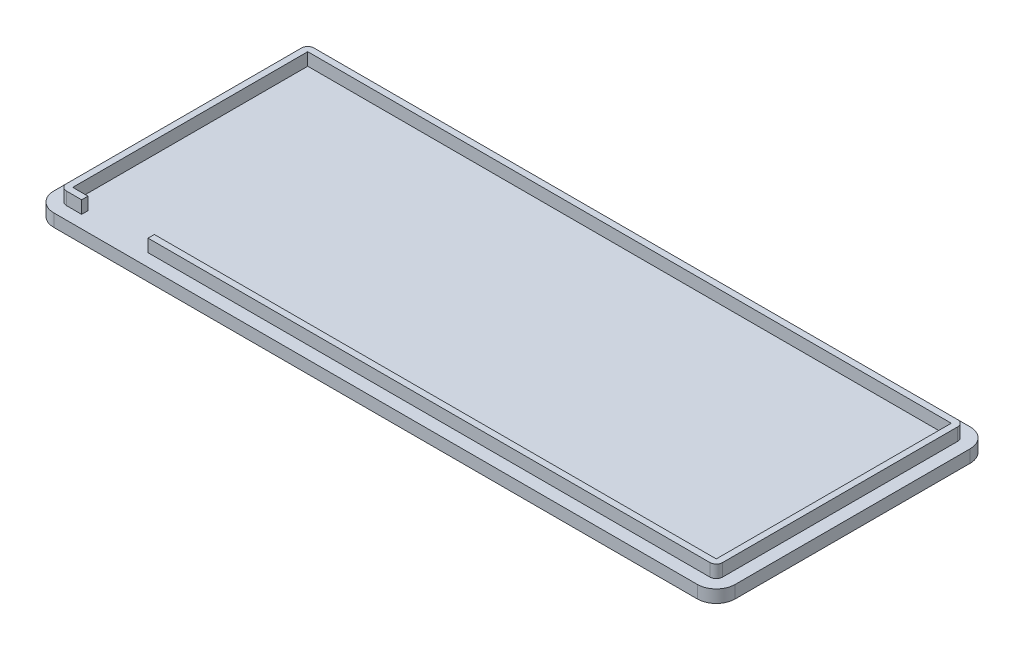
ISO-10303-21;
HEADER;
FILE_DESCRIPTION(('STEP AP214'),'2;1');
FILE_NAME('part.step','',(''),(''),'','','');
FILE_SCHEMA(('AUTOMOTIVE_DESIGN { 1 0 10303 214 1 1 1 1 }'));
ENDSEC;
DATA;
#1=APPLICATION_CONTEXT('core data for automotive mechanical design processes');
#2=APPLICATION_PROTOCOL_DEFINITION('international standard','automotive_design',2000,#1);
#3=PRODUCT_CONTEXT('',#1,'mechanical');
#4=PRODUCT('Part','Part','',(#3));
#5=PRODUCT_RELATED_PRODUCT_CATEGORY('part','',(#4));
#6=PRODUCT_DEFINITION_FORMATION('','',#4);
#7=PRODUCT_DEFINITION_CONTEXT('part definition',#1,'design');
#8=PRODUCT_DEFINITION('design','',#6,#7);
#9=PRODUCT_DEFINITION_SHAPE('','',#8);
#10=(LENGTH_UNIT() NAMED_UNIT(*) SI_UNIT(.MILLI.,.METRE.));
#11=(NAMED_UNIT(*) PLANE_ANGLE_UNIT() SI_UNIT($,.RADIAN.));
#12=(NAMED_UNIT(*) SI_UNIT($,.STERADIAN.) SOLID_ANGLE_UNIT());
#13=UNCERTAINTY_MEASURE_WITH_UNIT(LENGTH_MEASURE(1.E-05),#10,'distance_accuracy_value','');
#14=(GEOMETRIC_REPRESENTATION_CONTEXT(3) GLOBAL_UNCERTAINTY_ASSIGNED_CONTEXT((#13)) GLOBAL_UNIT_ASSIGNED_CONTEXT((#10,
#11,#12)) REPRESENTATION_CONTEXT('',''));
#15=CARTESIAN_POINT('',(0.,0.,0.));
#16=DIRECTION('',(0.,0.,1.));
#17=DIRECTION('',(1.,0.,0.));
#18=AXIS2_PLACEMENT_3D('',#15,#16,#17);
#19=CARTESIAN_POINT('',(51.,4.,19.625));
#20=DIRECTION('',(0.,0.,-1.));
#21=DIRECTION('',(-1.,0.,0.));
#22=AXIS2_PLACEMENT_3D('',#19,#20,#21);
#23=PLANE('',#22);
#24=DIRECTION('',(1.,0.,0.));
#25=VECTOR('',#24,1.);
#26=CARTESIAN_POINT('',(51.,2.,19.625));
#27=LINE('',#26,#25);
#28=CARTESIAN_POINT('',(-51.,2.,19.625));
#29=VERTEX_POINT('',#28);
#30=CARTESIAN_POINT('',(-48.5847,2.,19.625));
#31=VERTEX_POINT('',#30);
#32=EDGE_CURVE('E55',#29,#31,#27,.T.);
#33=ORIENTED_EDGE('',*,*,#32,.T.);
#34=DIRECTION('',(0.,-1.,0.));
#35=VECTOR('',#34,1.);
#36=CARTESIAN_POINT('',(-48.5847,2.,19.625));
#37=LINE('',#36,#35);
#38=CARTESIAN_POINT('',(-48.5847,4.,19.625));
#39=VERTEX_POINT('',#38);
#40=EDGE_CURVE('E202',#39,#31,#37,.T.);
#41=ORIENTED_EDGE('',*,*,#40,.F.);
#42=DIRECTION('',(1.,0.,0.));
#43=VECTOR('',#42,1.);
#44=CARTESIAN_POINT('',(51.,4.,19.625));
#45=LINE('',#44,#43);
#46=CARTESIAN_POINT('',(-51.,4.,19.625));
#47=VERTEX_POINT('',#46);
#48=EDGE_CURVE('E390',#47,#39,#45,.T.);
#49=ORIENTED_EDGE('',*,*,#48,.F.);
#50=DIRECTION('',(0.,-1.,0.));
#51=VECTOR('',#50,1.);
#52=CARTESIAN_POINT('',(-51.,4.,19.625));
#53=LINE('',#52,#51);
#54=EDGE_CURVE('E210',#47,#29,#53,.T.);
#55=ORIENTED_EDGE('',*,*,#54,.T.);
#56=EDGE_LOOP('',(#33,#41,#49,#55));
#57=FACE_BOUND('',#56,.T.);
#58=ADVANCED_FACE('F33',(#57),#23,.F.);
#59=CARTESIAN_POINT('',(51.,4.,18.625));
#60=DIRECTION('',(0.,0.,-1.));
#61=DIRECTION('',(-1.,0.,0.));
#62=AXIS2_PLACEMENT_3D('',#59,#60,#61);
#63=PLANE('',#62);
#64=DIRECTION('',(0.,1.,0.));
#65=VECTOR('',#64,1.);
#66=CARTESIAN_POINT('',(-48.5847,4.,18.625));
#67=LINE('',#66,#65);
#68=CARTESIAN_POINT('',(-48.5847,2.,18.625));
#69=VERTEX_POINT('',#68);
#70=CARTESIAN_POINT('',(-48.5847,4.,18.625));
#71=VERTEX_POINT('',#70);
#72=EDGE_CURVE('E447',#69,#71,#67,.T.);
#73=ORIENTED_EDGE('',*,*,#72,.F.);
#74=DIRECTION('',(1.,0.,0.));
#75=VECTOR('',#74,1.);
#76=CARTESIAN_POINT('',(51.,2.,18.625));
#77=LINE('',#76,#75);
#78=CARTESIAN_POINT('',(-51.,2.,18.625));
#79=VERTEX_POINT('',#78);
#80=EDGE_CURVE('E196',#79,#69,#77,.T.);
#81=ORIENTED_EDGE('',*,*,#80,.F.);
#82=DIRECTION('',(0.,-1.,0.));
#83=VECTOR('',#82,1.);
#84=CARTESIAN_POINT('',(-51.,4.,18.625));
#85=LINE('',#84,#83);
#86=CARTESIAN_POINT('',(-51.,4.,18.625));
#87=VERTEX_POINT('',#86);
#88=EDGE_CURVE('E412',#87,#79,#85,.T.);
#89=ORIENTED_EDGE('',*,*,#88,.F.);
#90=DIRECTION('',(1.,0.,0.));
#91=VECTOR('',#90,1.);
#92=CARTESIAN_POINT('',(51.,4.,18.625));
#93=LINE('',#92,#91);
#94=EDGE_CURVE('E441',#87,#71,#93,.T.);
#95=ORIENTED_EDGE('',*,*,#94,.T.);
#96=EDGE_LOOP('',(#73,#81,#89,#95));
#97=FACE_BOUND('',#96,.T.);
#98=ADVANCED_FACE('F360',(#97),#63,.T.);
#99=CARTESIAN_POINT('',(-51.,2.,18.625));
#100=DIRECTION('',(0.,-1.,0.));
#101=DIRECTION('',(0.,0.,-1.));
#102=AXIS2_PLACEMENT_3D('',#99,#100,#101);
#103=CYLINDRICAL_SURFACE('',#102,3.);
#104=CARTESIAN_POINT('',(-51.,0.,18.625));
#105=DIRECTION('',(0.,1.,0.));
#106=DIRECTION('',(0.,0.,-1.));
#107=AXIS2_PLACEMENT_3D('',#104,#105,#106);
#108=CIRCLE('',#107,3.);
#109=CARTESIAN_POINT('',(-54.,0.,18.625));
#110=VERTEX_POINT('',#109);
#111=CARTESIAN_POINT('',(-51.,0.,21.625));
#112=VERTEX_POINT('',#111);
#113=EDGE_CURVE('E260',#110,#112,#108,.T.);
#114=ORIENTED_EDGE('',*,*,#113,.T.);
#115=DIRECTION('',(0.,-1.,0.));
#116=VECTOR('',#115,1.);
#117=CARTESIAN_POINT('',(-51.,2.,21.625));
#118=LINE('',#117,#116);
#119=CARTESIAN_POINT('',(-51.,2.,21.625));
#120=VERTEX_POINT('',#119);
#121=EDGE_CURVE('E11',#120,#112,#118,.T.);
#122=ORIENTED_EDGE('',*,*,#121,.F.);
#123=CARTESIAN_POINT('',(-51.,2.,18.625));
#124=DIRECTION('',(0.,1.,0.));
#125=DIRECTION('',(0.,0.,-1.));
#126=AXIS2_PLACEMENT_3D('',#123,#124,#125);
#127=CIRCLE('',#126,3.);
#128=CARTESIAN_POINT('',(-54.,2.,18.625));
#129=VERTEX_POINT('',#128);
#130=EDGE_CURVE('E261',#129,#120,#127,.T.);
#131=ORIENTED_EDGE('',*,*,#130,.F.);
#132=DIRECTION('',(0.,-1.,0.));
#133=VECTOR('',#132,1.);
#134=CARTESIAN_POINT('',(-54.,2.,18.625));
#135=LINE('',#134,#133);
#136=EDGE_CURVE('E279',#129,#110,#135,.T.);
#137=ORIENTED_EDGE('',*,*,#136,.T.);
#138=EDGE_LOOP('',(#114,#122,#131,#137));
#139=FACE_BOUND('',#138,.T.);
#140=ADVANCED_FACE('F35',(#139),#103,.T.);
#141=CARTESIAN_POINT('',(51.,2.,21.625));
#142=DIRECTION('',(0.,0.,-1.));
#143=DIRECTION('',(-1.,0.,0.));
#144=AXIS2_PLACEMENT_3D('',#141,#142,#143);
#145=PLANE('',#144);
#146=DIRECTION('',(1.,0.,0.));
#147=VECTOR('',#146,1.);
#148=CARTESIAN_POINT('',(51.,0.,21.625));
#149=LINE('',#148,#147);
#150=CARTESIAN_POINT('',(51.,0.,21.625));
#151=VERTEX_POINT('',#150);
#152=EDGE_CURVE('E282',#112,#151,#149,.T.);
#153=ORIENTED_EDGE('',*,*,#152,.T.);
#154=DIRECTION('',(0.,-1.,0.));
#155=VECTOR('',#154,1.);
#156=CARTESIAN_POINT('',(51.,2.,21.625));
#157=LINE('',#156,#155);
#158=CARTESIAN_POINT('',(51.,2.,21.625));
#159=VERTEX_POINT('',#158);
#160=EDGE_CURVE('E41',#159,#151,#157,.T.);
#161=ORIENTED_EDGE('',*,*,#160,.F.);
#162=DIRECTION('',(1.,0.,0.));
#163=VECTOR('',#162,1.);
#164=CARTESIAN_POINT('',(51.,2.,21.625));
#165=LINE('',#164,#163);
#166=EDGE_CURVE('E264',#120,#159,#165,.T.);
#167=ORIENTED_EDGE('',*,*,#166,.F.);
#168=ORIENTED_EDGE('',*,*,#121,.T.);
#169=EDGE_LOOP('',(#153,#161,#167,#168));
#170=FACE_BOUND('',#169,.T.);
#171=ADVANCED_FACE('F337',(#170),#145,.F.);
#172=CARTESIAN_POINT('',(51.,2.,18.625));
#173=DIRECTION('',(0.,-1.,0.));
#174=DIRECTION('',(0.,0.,-1.));
#175=AXIS2_PLACEMENT_3D('',#172,#173,#174);
#176=CYLINDRICAL_SURFACE('',#175,3.);
#177=CARTESIAN_POINT('',(51.,0.,18.625));
#178=DIRECTION('',(0.,1.,0.));
#179=DIRECTION('',(0.,0.,1.));
#180=AXIS2_PLACEMENT_3D('',#177,#178,#179);
#181=CIRCLE('',#180,3.);
#182=CARTESIAN_POINT('',(54.,0.,18.625));
#183=VERTEX_POINT('',#182);
#184=EDGE_CURVE('E284',#151,#183,#181,.T.);
#185=ORIENTED_EDGE('',*,*,#184,.T.);
#186=DIRECTION('',(0.,-1.,0.));
#187=VECTOR('',#186,1.);
#188=CARTESIAN_POINT('',(54.,2.,18.625));
#189=LINE('',#188,#187);
#190=CARTESIAN_POINT('',(54.,2.,18.625));
#191=VERTEX_POINT('',#190);
#192=EDGE_CURVE('E309',#191,#183,#189,.T.);
#193=ORIENTED_EDGE('',*,*,#192,.F.);
#194=CARTESIAN_POINT('',(51.,2.,18.625));
#195=DIRECTION('',(0.,1.,0.));
#196=DIRECTION('',(0.,0.,1.));
#197=AXIS2_PLACEMENT_3D('',#194,#195,#196);
#198=CIRCLE('',#197,3.);
#199=EDGE_CURVE('E267',#159,#191,#198,.T.);
#200=ORIENTED_EDGE('',*,*,#199,.F.);
#201=ORIENTED_EDGE('',*,*,#160,.T.);
#202=EDGE_LOOP('',(#185,#193,#200,#201));
#203=FACE_BOUND('',#202,.T.);
#204=ADVANCED_FACE('F316',(#203),#176,.T.);
#205=CARTESIAN_POINT('',(54.,2.,18.625));
#206=DIRECTION('',(-1.,0.,0.));
#207=DIRECTION('',(0.,0.,1.));
#208=AXIS2_PLACEMENT_3D('',#205,#206,#207);
#209=PLANE('',#208);
#210=DIRECTION('',(0.,0.,-1.));
#211=VECTOR('',#210,1.);
#212=CARTESIAN_POINT('',(54.,0.,18.625));
#213=LINE('',#212,#211);
#214=CARTESIAN_POINT('',(54.,0.,-18.625));
#215=VERTEX_POINT('',#214);
#216=EDGE_CURVE('E286',#183,#215,#213,.T.);
#217=ORIENTED_EDGE('',*,*,#216,.T.);
#218=DIRECTION('',(0.,-1.,0.));
#219=VECTOR('',#218,1.);
#220=CARTESIAN_POINT('',(54.,2.,-18.625));
#221=LINE('',#220,#219);
#222=CARTESIAN_POINT('',(54.,2.,-18.625));
#223=VERTEX_POINT('',#222);
#224=EDGE_CURVE('E306',#223,#215,#221,.T.);
#225=ORIENTED_EDGE('',*,*,#224,.F.);
#226=DIRECTION('',(0.,0.,-1.));
#227=VECTOR('',#226,1.);
#228=CARTESIAN_POINT('',(54.,2.,18.625));
#229=LINE('',#228,#227);
#230=EDGE_CURVE('E269',#191,#223,#229,.T.);
#231=ORIENTED_EDGE('',*,*,#230,.F.);
#232=ORIENTED_EDGE('',*,*,#192,.T.);
#233=EDGE_LOOP('',(#217,#225,#231,#232));
#234=FACE_BOUND('',#233,.T.);
#235=ADVANCED_FACE('F327',(#234),#209,.F.);
#236=CARTESIAN_POINT('',(51.,2.,-18.625));
#237=DIRECTION('',(0.,-1.,0.));
#238=DIRECTION('',(0.,0.,-1.));
#239=AXIS2_PLACEMENT_3D('',#236,#237,#238);
#240=CYLINDRICAL_SURFACE('',#239,3.);
#241=CARTESIAN_POINT('',(51.,0.,-18.625));
#242=DIRECTION('',(0.,1.,0.));
#243=DIRECTION('',(0.,0.,1.));
#244=AXIS2_PLACEMENT_3D('',#241,#242,#243);
#245=CIRCLE('',#244,3.);
#246=CARTESIAN_POINT('',(51.,0.,-21.625));
#247=VERTEX_POINT('',#246);
#248=EDGE_CURVE('E288',#215,#247,#245,.T.);
#249=ORIENTED_EDGE('',*,*,#248,.T.);
#250=DIRECTION('',(0.,-1.,0.));
#251=VECTOR('',#250,1.);
#252=CARTESIAN_POINT('',(51.,2.,-21.625));
#253=LINE('',#252,#251);
#254=CARTESIAN_POINT('',(51.,2.,-21.625));
#255=VERTEX_POINT('',#254);
#256=EDGE_CURVE('E303',#255,#247,#253,.T.);
#257=ORIENTED_EDGE('',*,*,#256,.F.);
#258=CARTESIAN_POINT('',(51.,2.,-18.625));
#259=DIRECTION('',(0.,1.,0.));
#260=DIRECTION('',(0.,0.,1.));
#261=AXIS2_PLACEMENT_3D('',#258,#259,#260);
#262=CIRCLE('',#261,3.);
#263=EDGE_CURVE('E271',#223,#255,#262,.T.);
#264=ORIENTED_EDGE('',*,*,#263,.F.);
#265=ORIENTED_EDGE('',*,*,#224,.T.);
#266=EDGE_LOOP('',(#249,#257,#264,#265));
#267=FACE_BOUND('',#266,.T.);
#268=ADVANCED_FACE('F331',(#267),#240,.T.);
#269=CARTESIAN_POINT('',(51.,2.,-21.625));
#270=DIRECTION('',(0.,0.,1.));
#271=DIRECTION('',(1.,0.,0.));
#272=AXIS2_PLACEMENT_3D('',#269,#270,#271);
#273=PLANE('',#272);
#274=DIRECTION('',(-1.,0.,0.));
#275=VECTOR('',#274,1.);
#276=CARTESIAN_POINT('',(51.,0.,-21.625));
#277=LINE('',#276,#275);
#278=CARTESIAN_POINT('',(-51.,0.,-21.625));
#279=VERTEX_POINT('',#278);
#280=EDGE_CURVE('E290',#247,#279,#277,.T.);
#281=ORIENTED_EDGE('',*,*,#280,.T.);
#282=DIRECTION('',(0.,-1.,0.));
#283=VECTOR('',#282,1.);
#284=CARTESIAN_POINT('',(-51.,2.,-21.625));
#285=LINE('',#284,#283);
#286=CARTESIAN_POINT('',(-51.,2.,-21.625));
#287=VERTEX_POINT('',#286);
#288=EDGE_CURVE('E300',#287,#279,#285,.T.);
#289=ORIENTED_EDGE('',*,*,#288,.F.);
#290=DIRECTION('',(-1.,0.,0.));
#291=VECTOR('',#290,1.);
#292=CARTESIAN_POINT('',(51.,2.,-21.625));
#293=LINE('',#292,#291);
#294=EDGE_CURVE('E273',#255,#287,#293,.T.);
#295=ORIENTED_EDGE('',*,*,#294,.F.);
#296=ORIENTED_EDGE('',*,*,#256,.T.);
#297=EDGE_LOOP('',(#281,#289,#295,#296));
#298=FACE_BOUND('',#297,.T.);
#299=ADVANCED_FACE('F350',(#298),#273,.F.);
#300=CARTESIAN_POINT('',(-51.,2.,-18.625));
#301=DIRECTION('',(0.,-1.,0.));
#302=DIRECTION('',(0.,0.,-1.));
#303=AXIS2_PLACEMENT_3D('',#300,#301,#302);
#304=CYLINDRICAL_SURFACE('',#303,3.);
#305=CARTESIAN_POINT('',(-51.,0.,-18.625));
#306=DIRECTION('',(0.,1.,0.));
#307=DIRECTION('',(0.,0.,1.));
#308=AXIS2_PLACEMENT_3D('',#305,#306,#307);
#309=CIRCLE('',#308,3.);
#310=CARTESIAN_POINT('',(-54.,0.,-18.625));
#311=VERTEX_POINT('',#310);
#312=EDGE_CURVE('E292',#279,#311,#309,.T.);
#313=ORIENTED_EDGE('',*,*,#312,.T.);
#314=DIRECTION('',(0.,-1.,0.));
#315=VECTOR('',#314,1.);
#316=CARTESIAN_POINT('',(-54.,2.,-18.625));
#317=LINE('',#316,#315);
#318=CARTESIAN_POINT('',(-54.,2.,-18.625));
#319=VERTEX_POINT('',#318);
#320=EDGE_CURVE('E297',#319,#311,#317,.T.);
#321=ORIENTED_EDGE('',*,*,#320,.F.);
#322=CARTESIAN_POINT('',(-51.,2.,-18.625));
#323=DIRECTION('',(0.,1.,0.));
#324=DIRECTION('',(0.,0.,1.));
#325=AXIS2_PLACEMENT_3D('',#322,#323,#324);
#326=CIRCLE('',#325,3.);
#327=EDGE_CURVE('E275',#287,#319,#326,.T.);
#328=ORIENTED_EDGE('',*,*,#327,.F.);
#329=ORIENTED_EDGE('',*,*,#288,.T.);
#330=EDGE_LOOP('',(#313,#321,#328,#329));
#331=FACE_BOUND('',#330,.T.);
#332=ADVANCED_FACE('F348',(#331),#304,.T.);
#333=CARTESIAN_POINT('',(-54.,2.,18.625));
#334=DIRECTION('',(1.,0.,0.));
#335=DIRECTION('',(0.,0.,-1.));
#336=AXIS2_PLACEMENT_3D('',#333,#334,#335);
#337=PLANE('',#336);
#338=DIRECTION('',(0.,0.,1.));
#339=VECTOR('',#338,1.);
#340=CARTESIAN_POINT('',(-54.,0.,18.625));
#341=LINE('',#340,#339);
#342=EDGE_CURVE('E265',#311,#110,#341,.T.);
#343=ORIENTED_EDGE('',*,*,#342,.T.);
#344=ORIENTED_EDGE('',*,*,#136,.F.);
#345=DIRECTION('',(0.,0.,1.));
#346=VECTOR('',#345,1.);
#347=CARTESIAN_POINT('',(-54.,2.,18.625));
#348=LINE('',#347,#346);
#349=EDGE_CURVE('E277',#319,#129,#348,.T.);
#350=ORIENTED_EDGE('',*,*,#349,.F.);
#351=ORIENTED_EDGE('',*,*,#320,.T.);
#352=EDGE_LOOP('',(#343,#344,#350,#351));
#353=FACE_BOUND('',#352,.T.);
#354=ADVANCED_FACE('F343',(#353),#337,.F.);
#355=CARTESIAN_POINT('',(-51.,0.,18.625));
#356=DIRECTION('',(0.,-1.,0.));
#357=DIRECTION('',(0.,0.,-1.));
#358=AXIS2_PLACEMENT_3D('',#355,#356,#357);
#359=PLANE('',#358);
#360=ORIENTED_EDGE('',*,*,#113,.F.);
#361=ORIENTED_EDGE('',*,*,#342,.F.);
#362=ORIENTED_EDGE('',*,*,#312,.F.);
#363=ORIENTED_EDGE('',*,*,#280,.F.);
#364=ORIENTED_EDGE('',*,*,#248,.F.);
#365=ORIENTED_EDGE('',*,*,#216,.F.);
#366=ORIENTED_EDGE('',*,*,#184,.F.);
#367=ORIENTED_EDGE('',*,*,#152,.F.);
#368=EDGE_LOOP('',(#360,#361,#362,#363,#364,#365,#366,#367));
#369=FACE_BOUND('',#368,.T.);
#370=ADVANCED_FACE('F322',(#369),#359,.T.);
#371=CARTESIAN_POINT('',(-51.,4.,18.625));
#372=DIRECTION('',(0.,-1.,0.));
#373=DIRECTION('',(0.,0.,-1.));
#374=AXIS2_PLACEMENT_3D('',#371,#372,#373);
#375=PLANE('',#374);
#376=ORIENTED_EDGE('',*,*,#48,.T.);
#377=DIRECTION('',(0.,0.,-1.));
#378=VECTOR('',#377,1.);
#379=CARTESIAN_POINT('',(-48.5847,4.,18.625));
#380=LINE('',#379,#378);
#381=EDGE_CURVE('E205',#39,#71,#380,.T.);
#382=ORIENTED_EDGE('',*,*,#381,.T.);
#383=ORIENTED_EDGE('',*,*,#94,.F.);
#384=DIRECTION('',(0.,0.,1.));
#385=VECTOR('',#384,1.);
#386=CARTESIAN_POINT('',(-51.,4.,18.625));
#387=LINE('',#386,#385);
#388=CARTESIAN_POINT('',(-51.,4.,-18.625));
#389=VERTEX_POINT('',#388);
#390=EDGE_CURVE('E429',#389,#87,#387,.T.);
#391=ORIENTED_EDGE('',*,*,#390,.F.);
#392=DIRECTION('',(-1.,0.,0.));
#393=VECTOR('',#392,1.);
#394=CARTESIAN_POINT('',(51.,4.,-18.625));
#395=LINE('',#394,#393);
#396=CARTESIAN_POINT('',(51.,4.,-18.625));
#397=VERTEX_POINT('',#396);
#398=EDGE_CURVE('E425',#397,#389,#395,.T.);
#399=ORIENTED_EDGE('',*,*,#398,.F.);
#400=DIRECTION('',(0.,0.,-1.));
#401=VECTOR('',#400,1.);
#402=CARTESIAN_POINT('',(51.,4.,18.625));
#403=LINE('',#402,#401);
#404=CARTESIAN_POINT('',(51.,4.,18.625));
#405=VERTEX_POINT('',#404);
#406=EDGE_CURVE('E438',#405,#397,#403,.T.);
#407=ORIENTED_EDGE('',*,*,#406,.F.);
#408=CARTESIAN_POINT('',(-38.0582,4.,18.625));
#409=VERTEX_POINT('',#408);
#410=EDGE_CURVE('E444',#409,#405,#93,.T.);
#411=ORIENTED_EDGE('',*,*,#410,.F.);
#412=DIRECTION('',(0.,0.,1.));
#413=VECTOR('',#412,1.);
#414=CARTESIAN_POINT('',(-38.0582,4.,18.625));
#415=LINE('',#414,#413);
#416=CARTESIAN_POINT('',(-38.0582,4.,19.625));
#417=VERTEX_POINT('',#416);
#418=EDGE_CURVE('E449',#409,#417,#415,.T.);
#419=ORIENTED_EDGE('',*,*,#418,.T.);
#420=CARTESIAN_POINT('',(51.,4.,19.625));
#421=VERTEX_POINT('',#420);
#422=EDGE_CURVE('E386',#417,#421,#45,.T.);
#423=ORIENTED_EDGE('',*,*,#422,.T.);
#424=CARTESIAN_POINT('',(51.,4.,18.625));
#425=DIRECTION('',(0.,1.,0.));
#426=DIRECTION('',(0.,0.,1.));
#427=AXIS2_PLACEMENT_3D('',#424,#425,#426);
#428=CIRCLE('',#427,1.);
#429=CARTESIAN_POINT('',(52.,4.,18.625));
#430=VERTEX_POINT('',#429);
#431=EDGE_CURVE('E392',#421,#430,#428,.T.);
#432=ORIENTED_EDGE('',*,*,#431,.T.);
#433=DIRECTION('',(0.,0.,-1.));
#434=VECTOR('',#433,1.);
#435=CARTESIAN_POINT('',(52.,4.,18.625));
#436=LINE('',#435,#434);
#437=CARTESIAN_POINT('',(52.,4.,-18.625));
#438=VERTEX_POINT('',#437);
#439=EDGE_CURVE('E398',#430,#438,#436,.T.);
#440=ORIENTED_EDGE('',*,*,#439,.T.);
#441=CARTESIAN_POINT('',(51.,4.,-18.625));
#442=DIRECTION('',(0.,1.,0.));
#443=DIRECTION('',(0.,0.,1.));
#444=AXIS2_PLACEMENT_3D('',#441,#442,#443);
#445=CIRCLE('',#444,1.);
#446=CARTESIAN_POINT('',(51.,4.,-19.625));
#447=VERTEX_POINT('',#446);
#448=EDGE_CURVE('E400',#438,#447,#445,.T.);
#449=ORIENTED_EDGE('',*,*,#448,.T.);
#450=DIRECTION('',(-1.,0.,0.));
#451=VECTOR('',#450,1.);
#452=CARTESIAN_POINT('',(51.,4.,-19.625));
#453=LINE('',#452,#451);
#454=CARTESIAN_POINT('',(-51.,4.,-19.625));
#455=VERTEX_POINT('',#454);
#456=EDGE_CURVE('E402',#447,#455,#453,.T.);
#457=ORIENTED_EDGE('',*,*,#456,.T.);
#458=CARTESIAN_POINT('',(-51.,4.,-18.625));
#459=DIRECTION('',(0.,1.,0.));
#460=DIRECTION('',(0.,0.,1.));
#461=AXIS2_PLACEMENT_3D('',#458,#459,#460);
#462=CIRCLE('',#461,1.);
#463=CARTESIAN_POINT('',(-52.,4.,-18.625));
#464=VERTEX_POINT('',#463);
#465=EDGE_CURVE('E404',#455,#464,#462,.T.);
#466=ORIENTED_EDGE('',*,*,#465,.T.);
#467=DIRECTION('',(0.,0.,1.));
#468=VECTOR('',#467,1.);
#469=CARTESIAN_POINT('',(-52.,4.,18.625));
#470=LINE('',#469,#468);
#471=CARTESIAN_POINT('',(-52.,4.,18.625));
#472=VERTEX_POINT('',#471);
#473=EDGE_CURVE('E241',#464,#472,#470,.T.);
#474=ORIENTED_EDGE('',*,*,#473,.T.);
#475=CARTESIAN_POINT('',(-51.,4.,18.625));
#476=DIRECTION('',(0.,1.,0.));
#477=DIRECTION('',(0.,0.,-1.));
#478=AXIS2_PLACEMENT_3D('',#475,#476,#477);
#479=CIRCLE('',#478,1.);
#480=EDGE_CURVE('E236',#472,#47,#479,.T.);
#481=ORIENTED_EDGE('',*,*,#480,.T.);
#482=EDGE_LOOP('',(#376,#382,#383,#391,#399,#407,#411,#419,#423,#432,#440,#449,#457,#466,#474,#481));
#483=FACE_BOUND('',#482,.T.);
#484=ADVANCED_FACE('F381',(#483),#375,.F.);
#485=CARTESIAN_POINT('',(-51.,4.,18.625));
#486=DIRECTION('',(0.,-1.,0.));
#487=DIRECTION('',(0.,0.,-1.));
#488=AXIS2_PLACEMENT_3D('',#485,#486,#487);
#489=CYLINDRICAL_SURFACE('',#488,1.);
#490=CARTESIAN_POINT('',(-51.,2.,18.625));
#491=DIRECTION('',(0.,1.,0.));
#492=DIRECTION('',(0.,0.,-1.));
#493=AXIS2_PLACEMENT_3D('',#490,#491,#492);
#494=CIRCLE('',#493,1.);
#495=CARTESIAN_POINT('',(-52.,2.,18.625));
#496=VERTEX_POINT('',#495);
#497=EDGE_CURVE('E218',#496,#29,#494,.T.);
#498=ORIENTED_EDGE('',*,*,#497,.T.);
#499=ORIENTED_EDGE('',*,*,#54,.F.);
#500=ORIENTED_EDGE('',*,*,#480,.F.);
#501=DIRECTION('',(0.,-1.,0.));
#502=VECTOR('',#501,1.);
#503=CARTESIAN_POINT('',(-52.,4.,18.625));
#504=LINE('',#503,#502);
#505=EDGE_CURVE('E237',#472,#496,#504,.T.);
#506=ORIENTED_EDGE('',*,*,#505,.T.);
#507=EDGE_LOOP('',(#498,#499,#500,#506));
#508=FACE_BOUND('',#507,.T.);
#509=ADVANCED_FACE('F373',(#508),#489,.T.);
#510=ORIENTED_EDGE('',*,*,#422,.F.);
#511=DIRECTION('',(0.,1.,0.));
#512=VECTOR('',#511,1.);
#513=CARTESIAN_POINT('',(-38.0582,2.,19.625));
#514=LINE('',#513,#512);
#515=CARTESIAN_POINT('',(-38.0582,2.,19.625));
#516=VERTEX_POINT('',#515);
#517=EDGE_CURVE('E199',#516,#417,#514,.T.);
#518=ORIENTED_EDGE('',*,*,#517,.F.);
#519=CARTESIAN_POINT('',(51.,2.,19.625));
#520=VERTEX_POINT('',#519);
#521=EDGE_CURVE('E213',#516,#520,#27,.T.);
#522=ORIENTED_EDGE('',*,*,#521,.T.);
#523=DIRECTION('',(0.,-1.,0.));
#524=VECTOR('',#523,1.);
#525=CARTESIAN_POINT('',(51.,4.,19.625));
#526=LINE('',#525,#524);
#527=EDGE_CURVE('E256',#421,#520,#526,.T.);
#528=ORIENTED_EDGE('',*,*,#527,.F.);
#529=EDGE_LOOP('',(#510,#518,#522,#528));
#530=FACE_BOUND('',#529,.T.);
#531=ADVANCED_FACE('F362',(#530),#23,.F.);
#532=CARTESIAN_POINT('',(51.,4.,18.625));
#533=DIRECTION('',(0.,-1.,0.));
#534=DIRECTION('',(0.,0.,-1.));
#535=AXIS2_PLACEMENT_3D('',#532,#533,#534);
#536=CYLINDRICAL_SURFACE('',#535,1.);
#537=CARTESIAN_POINT('',(51.,2.,18.625));
#538=DIRECTION('',(0.,1.,0.));
#539=DIRECTION('',(0.,0.,1.));
#540=AXIS2_PLACEMENT_3D('',#537,#538,#539);
#541=CIRCLE('',#540,1.);
#542=CARTESIAN_POINT('',(52.,2.,18.625));
#543=VERTEX_POINT('',#542);
#544=EDGE_CURVE('E212',#520,#543,#541,.T.);
#545=ORIENTED_EDGE('',*,*,#544,.T.);
#546=DIRECTION('',(0.,-1.,0.));
#547=VECTOR('',#546,1.);
#548=CARTESIAN_POINT('',(52.,4.,18.625));
#549=LINE('',#548,#547);
#550=EDGE_CURVE('E253',#430,#543,#549,.T.);
#551=ORIENTED_EDGE('',*,*,#550,.F.);
#552=ORIENTED_EDGE('',*,*,#431,.F.);
#553=ORIENTED_EDGE('',*,*,#527,.T.);
#554=EDGE_LOOP('',(#545,#551,#552,#553));
#555=FACE_BOUND('',#554,.T.);
#556=ADVANCED_FACE('F372',(#555),#536,.T.);
#557=CARTESIAN_POINT('',(52.,4.,18.625));
#558=DIRECTION('',(-1.,0.,0.));
#559=DIRECTION('',(0.,0.,1.));
#560=AXIS2_PLACEMENT_3D('',#557,#558,#559);
#561=PLANE('',#560);
#562=DIRECTION('',(0.,0.,-1.));
#563=VECTOR('',#562,1.);
#564=CARTESIAN_POINT('',(52.,2.,18.625));
#565=LINE('',#564,#563);
#566=CARTESIAN_POINT('',(52.,2.,-18.625));
#567=VERTEX_POINT('',#566);
#568=EDGE_CURVE('E216',#543,#567,#565,.T.);
#569=ORIENTED_EDGE('',*,*,#568,.T.);
#570=DIRECTION('',(0.,-1.,0.));
#571=VECTOR('',#570,1.);
#572=CARTESIAN_POINT('',(52.,4.,-18.625));
#573=LINE('',#572,#571);
#574=EDGE_CURVE('E250',#438,#567,#573,.T.);
#575=ORIENTED_EDGE('',*,*,#574,.F.);
#576=ORIENTED_EDGE('',*,*,#439,.F.);
#577=ORIENTED_EDGE('',*,*,#550,.T.);
#578=EDGE_LOOP('',(#569,#575,#576,#577));
#579=FACE_BOUND('',#578,.T.);
#580=ADVANCED_FACE('F379',(#579),#561,.F.);
#581=CARTESIAN_POINT('',(51.,4.,-18.625));
#582=DIRECTION('',(0.,-1.,0.));
#583=DIRECTION('',(0.,0.,-1.));
#584=AXIS2_PLACEMENT_3D('',#581,#582,#583);
#585=CYLINDRICAL_SURFACE('',#584,1.);
#586=CARTESIAN_POINT('',(51.,2.,-18.625));
#587=DIRECTION('',(0.,1.,0.));
#588=DIRECTION('',(0.,0.,1.));
#589=AXIS2_PLACEMENT_3D('',#586,#587,#588);
#590=CIRCLE('',#589,1.);
#591=CARTESIAN_POINT('',(51.,2.,-19.625));
#592=VERTEX_POINT('',#591);
#593=EDGE_CURVE('E224',#567,#592,#590,.T.);
#594=ORIENTED_EDGE('',*,*,#593,.T.);
#595=DIRECTION('',(0.,-1.,0.));
#596=VECTOR('',#595,1.);
#597=CARTESIAN_POINT('',(51.,4.,-19.625));
#598=LINE('',#597,#596);
#599=EDGE_CURVE('E247',#447,#592,#598,.T.);
#600=ORIENTED_EDGE('',*,*,#599,.F.);
#601=ORIENTED_EDGE('',*,*,#448,.F.);
#602=ORIENTED_EDGE('',*,*,#574,.T.);
#603=EDGE_LOOP('',(#594,#600,#601,#602));
#604=FACE_BOUND('',#603,.T.);
#605=ADVANCED_FACE('F490',(#604),#585,.T.);
#606=CARTESIAN_POINT('',(51.,4.,-19.625));
#607=DIRECTION('',(0.,0.,1.));
#608=DIRECTION('',(1.,0.,0.));
#609=AXIS2_PLACEMENT_3D('',#606,#607,#608);
#610=PLANE('',#609);
#611=DIRECTION('',(-1.,0.,0.));
#612=VECTOR('',#611,1.);
#613=CARTESIAN_POINT('',(51.,2.,-19.625));
#614=LINE('',#613,#612);
#615=CARTESIAN_POINT('',(-51.,2.,-19.625));
#616=VERTEX_POINT('',#615);
#617=EDGE_CURVE('E227',#592,#616,#614,.T.);
#618=ORIENTED_EDGE('',*,*,#617,.T.);
#619=DIRECTION('',(0.,-1.,0.));
#620=VECTOR('',#619,1.);
#621=CARTESIAN_POINT('',(-51.,4.,-19.625));
#622=LINE('',#621,#620);
#623=EDGE_CURVE('E244',#455,#616,#622,.T.);
#624=ORIENTED_EDGE('',*,*,#623,.F.);
#625=ORIENTED_EDGE('',*,*,#456,.F.);
#626=ORIENTED_EDGE('',*,*,#599,.T.);
#627=EDGE_LOOP('',(#618,#624,#625,#626));
#628=FACE_BOUND('',#627,.T.);
#629=ADVANCED_FACE('F486',(#628),#610,.F.);
#630=CARTESIAN_POINT('',(-51.,4.,-18.625));
#631=DIRECTION('',(0.,-1.,0.));
#632=DIRECTION('',(0.,0.,-1.));
#633=AXIS2_PLACEMENT_3D('',#630,#631,#632);
#634=CYLINDRICAL_SURFACE('',#633,1.);
#635=CARTESIAN_POINT('',(-51.,2.,-18.625));
#636=DIRECTION('',(0.,1.,0.));
#637=DIRECTION('',(0.,0.,1.));
#638=AXIS2_PLACEMENT_3D('',#635,#636,#637);
#639=CIRCLE('',#638,1.);
#640=CARTESIAN_POINT('',(-52.,2.,-18.625));
#641=VERTEX_POINT('',#640);
#642=EDGE_CURVE('E230',#616,#641,#639,.T.);
#643=ORIENTED_EDGE('',*,*,#642,.T.);
#644=DIRECTION('',(0.,-1.,0.));
#645=VECTOR('',#644,1.);
#646=CARTESIAN_POINT('',(-52.,4.,-18.625));
#647=LINE('',#646,#645);
#648=EDGE_CURVE('E240',#464,#641,#647,.T.);
#649=ORIENTED_EDGE('',*,*,#648,.F.);
#650=ORIENTED_EDGE('',*,*,#465,.F.);
#651=ORIENTED_EDGE('',*,*,#623,.T.);
#652=EDGE_LOOP('',(#643,#649,#650,#651));
#653=FACE_BOUND('',#652,.T.);
#654=ADVANCED_FACE('F478',(#653),#634,.T.);
#655=CARTESIAN_POINT('',(-52.,4.,18.625));
#656=DIRECTION('',(1.,0.,0.));
#657=DIRECTION('',(0.,0.,-1.));
#658=AXIS2_PLACEMENT_3D('',#655,#656,#657);
#659=PLANE('',#658);
#660=DIRECTION('',(0.,0.,1.));
#661=VECTOR('',#660,1.);
#662=CARTESIAN_POINT('',(-52.,2.,18.625));
#663=LINE('',#662,#661);
#664=EDGE_CURVE('E233',#641,#496,#663,.T.);
#665=ORIENTED_EDGE('',*,*,#664,.T.);
#666=ORIENTED_EDGE('',*,*,#505,.F.);
#667=ORIENTED_EDGE('',*,*,#473,.F.);
#668=ORIENTED_EDGE('',*,*,#648,.T.);
#669=EDGE_LOOP('',(#665,#666,#667,#668));
#670=FACE_BOUND('',#669,.T.);
#671=ADVANCED_FACE('F411',(#670),#659,.F.);
#672=CARTESIAN_POINT('',(-51.,4.,18.625));
#673=DIRECTION('',(1.,0.,0.));
#674=DIRECTION('',(0.,0.,-1.));
#675=AXIS2_PLACEMENT_3D('',#672,#673,#674);
#676=PLANE('',#675);
#677=DIRECTION('',(0.,0.,1.));
#678=VECTOR('',#677,1.);
#679=CARTESIAN_POINT('',(-51.,2.,18.625));
#680=LINE('',#679,#678);
#681=CARTESIAN_POINT('',(-51.,2.,-18.625));
#682=VERTEX_POINT('',#681);
#683=EDGE_CURVE('E435',#682,#79,#680,.T.);
#684=ORIENTED_EDGE('',*,*,#683,.F.);
#685=DIRECTION('',(0.,-1.,0.));
#686=VECTOR('',#685,1.);
#687=CARTESIAN_POINT('',(-51.,4.,-18.625));
#688=LINE('',#687,#686);
#689=EDGE_CURVE('E423',#389,#682,#688,.T.);
#690=ORIENTED_EDGE('',*,*,#689,.F.);
#691=ORIENTED_EDGE('',*,*,#390,.T.);
#692=ORIENTED_EDGE('',*,*,#88,.T.);
#693=EDGE_LOOP('',(#684,#690,#691,#692));
#694=FACE_BOUND('',#693,.T.);
#695=ADVANCED_FACE('F471',(#694),#676,.T.);
#696=DIRECTION('',(0.,-1.,0.));
#697=VECTOR('',#696,1.);
#698=CARTESIAN_POINT('',(-38.0582,4.,18.625));
#699=LINE('',#698,#697);
#700=CARTESIAN_POINT('',(-38.0582,2.,18.625));
#701=VERTEX_POINT('',#700);
#702=EDGE_CURVE('E451',#409,#701,#699,.T.);
#703=ORIENTED_EDGE('',*,*,#702,.F.);
#704=ORIENTED_EDGE('',*,*,#410,.T.);
#705=DIRECTION('',(0.,-1.,0.));
#706=VECTOR('',#705,1.);
#707=CARTESIAN_POINT('',(51.,4.,18.625));
#708=LINE('',#707,#706);
#709=CARTESIAN_POINT('',(51.,2.,18.625));
#710=VERTEX_POINT('',#709);
#711=EDGE_CURVE('E414',#405,#710,#708,.T.);
#712=ORIENTED_EDGE('',*,*,#711,.T.);
#713=EDGE_CURVE('E434',#701,#710,#77,.T.);
#714=ORIENTED_EDGE('',*,*,#713,.F.);
#715=EDGE_LOOP('',(#703,#704,#712,#714));
#716=FACE_BOUND('',#715,.T.);
#717=ADVANCED_FACE('F368',(#716),#63,.T.);
#718=CARTESIAN_POINT('',(51.,4.,18.625));
#719=DIRECTION('',(-1.,0.,0.));
#720=DIRECTION('',(0.,0.,1.));
#721=AXIS2_PLACEMENT_3D('',#718,#719,#720);
#722=PLANE('',#721);
#723=DIRECTION('',(0.,0.,-1.));
#724=VECTOR('',#723,1.);
#725=CARTESIAN_POINT('',(51.,2.,18.625));
#726=LINE('',#725,#724);
#727=CARTESIAN_POINT('',(51.,2.,-18.625));
#728=VERTEX_POINT('',#727);
#729=EDGE_CURVE('E430',#710,#728,#726,.T.);
#730=ORIENTED_EDGE('',*,*,#729,.F.);
#731=ORIENTED_EDGE('',*,*,#711,.F.);
#732=ORIENTED_EDGE('',*,*,#406,.T.);
#733=DIRECTION('',(0.,-1.,0.));
#734=VECTOR('',#733,1.);
#735=CARTESIAN_POINT('',(51.,4.,-18.625));
#736=LINE('',#735,#734);
#737=EDGE_CURVE('E419',#397,#728,#736,.T.);
#738=ORIENTED_EDGE('',*,*,#737,.T.);
#739=EDGE_LOOP('',(#730,#731,#732,#738));
#740=FACE_BOUND('',#739,.T.);
#741=ADVANCED_FACE('F465',(#740),#722,.T.);
#742=CARTESIAN_POINT('',(51.,4.,-18.625));
#743=DIRECTION('',(0.,0.,1.));
#744=DIRECTION('',(1.,0.,0.));
#745=AXIS2_PLACEMENT_3D('',#742,#743,#744);
#746=PLANE('',#745);
#747=DIRECTION('',(-1.,0.,0.));
#748=VECTOR('',#747,1.);
#749=CARTESIAN_POINT('',(51.,2.,-18.625));
#750=LINE('',#749,#748);
#751=EDGE_CURVE('E426',#728,#682,#750,.T.);
#752=ORIENTED_EDGE('',*,*,#751,.F.);
#753=ORIENTED_EDGE('',*,*,#737,.F.);
#754=ORIENTED_EDGE('',*,*,#398,.T.);
#755=ORIENTED_EDGE('',*,*,#689,.T.);
#756=EDGE_LOOP('',(#752,#753,#754,#755));
#757=FACE_BOUND('',#756,.T.);
#758=ADVANCED_FACE('F468',(#757),#746,.T.);
#759=CARTESIAN_POINT('',(-51.,2.,18.625));
#760=DIRECTION('',(0.,-1.,0.));
#761=DIRECTION('',(0.,0.,-1.));
#762=AXIS2_PLACEMENT_3D('',#759,#760,#761);
#763=PLANE('',#762);
#764=ORIENTED_EDGE('',*,*,#80,.T.);
#765=DIRECTION('',(0.,0.,1.));
#766=VECTOR('',#765,1.);
#767=CARTESIAN_POINT('',(-48.5847,2.,17.625));
#768=LINE('',#767,#766);
#769=EDGE_CURVE('E191',#69,#31,#768,.T.);
#770=ORIENTED_EDGE('',*,*,#769,.T.);
#771=ORIENTED_EDGE('',*,*,#32,.F.);
#772=ORIENTED_EDGE('',*,*,#497,.F.);
#773=ORIENTED_EDGE('',*,*,#664,.F.);
#774=ORIENTED_EDGE('',*,*,#642,.F.);
#775=ORIENTED_EDGE('',*,*,#617,.F.);
#776=ORIENTED_EDGE('',*,*,#593,.F.);
#777=ORIENTED_EDGE('',*,*,#568,.F.);
#778=ORIENTED_EDGE('',*,*,#544,.F.);
#779=ORIENTED_EDGE('',*,*,#521,.F.);
#780=DIRECTION('',(0.,0.,1.));
#781=VECTOR('',#780,1.);
#782=CARTESIAN_POINT('',(-38.0582,2.,17.625));
#783=LINE('',#782,#781);
#784=EDGE_CURVE('E48',#701,#516,#783,.T.);
#785=ORIENTED_EDGE('',*,*,#784,.F.);
#786=ORIENTED_EDGE('',*,*,#713,.T.);
#787=ORIENTED_EDGE('',*,*,#729,.T.);
#788=ORIENTED_EDGE('',*,*,#751,.T.);
#789=ORIENTED_EDGE('',*,*,#683,.T.);
#790=EDGE_LOOP('',(#764,#770,#771,#772,#773,#774,#775,#776,#777,#778,#779,#785,#786,#787,#788,#789));
#791=FACE_BOUND('',#790,.T.);
#792=ORIENTED_EDGE('',*,*,#130,.T.);
#793=ORIENTED_EDGE('',*,*,#166,.T.);
#794=ORIENTED_EDGE('',*,*,#199,.T.);
#795=ORIENTED_EDGE('',*,*,#230,.T.);
#796=ORIENTED_EDGE('',*,*,#263,.T.);
#797=ORIENTED_EDGE('',*,*,#294,.T.);
#798=ORIENTED_EDGE('',*,*,#327,.T.);
#799=ORIENTED_EDGE('',*,*,#349,.T.);
#800=EDGE_LOOP('',(#792,#793,#794,#795,#796,#797,#798,#799));
#801=FACE_BOUND('',#800,.T.);
#802=ADVANCED_FACE('F193',(#791,#801),#763,.F.);
#803=CARTESIAN_POINT('',(-48.5847,2.,17.625));
#804=DIRECTION('',(-1.,0.,0.));
#805=DIRECTION('',(0.,0.,1.));
#806=AXIS2_PLACEMENT_3D('',#803,#804,#805);
#807=PLANE('',#806);
#808=ORIENTED_EDGE('',*,*,#40,.T.);
#809=ORIENTED_EDGE('',*,*,#769,.F.);
#810=ORIENTED_EDGE('',*,*,#72,.T.);
#811=ORIENTED_EDGE('',*,*,#381,.F.);
#812=EDGE_LOOP('',(#808,#809,#810,#811));
#813=FACE_BOUND('',#812,.T.);
#814=ADVANCED_FACE('F203',(#813),#807,.F.);
#815=CARTESIAN_POINT('',(-38.0582,2.,17.625));
#816=DIRECTION('',(1.,0.,0.));
#817=DIRECTION('',(0.,0.,-1.));
#818=AXIS2_PLACEMENT_3D('',#815,#816,#817);
#819=PLANE('',#818);
#820=ORIENTED_EDGE('',*,*,#702,.T.);
#821=ORIENTED_EDGE('',*,*,#784,.T.);
#822=ORIENTED_EDGE('',*,*,#517,.T.);
#823=ORIENTED_EDGE('',*,*,#418,.F.);
#824=EDGE_LOOP('',(#820,#821,#822,#823));
#825=FACE_BOUND('',#824,.T.);
#826=ADVANCED_FACE('F455',(#825),#819,.F.);
#827=CLOSED_SHELL('',(#58,#98,#140,#171,#204,#235,#268,#299,#332,#354,#370,#484,#509,#531,#556,
#580,#605,#629,#654,#671,#695,#717,#741,#758,#802,#814,#826));
#828=MANIFOLD_SOLID_BREP('B2',#827);
#829=ADVANCED_BREP_SHAPE_REPRESENTATION('',(#18,#828),#14);
#830=SHAPE_DEFINITION_REPRESENTATION(#9,#829);
ENDSEC;
END-ISO-10303-21;
